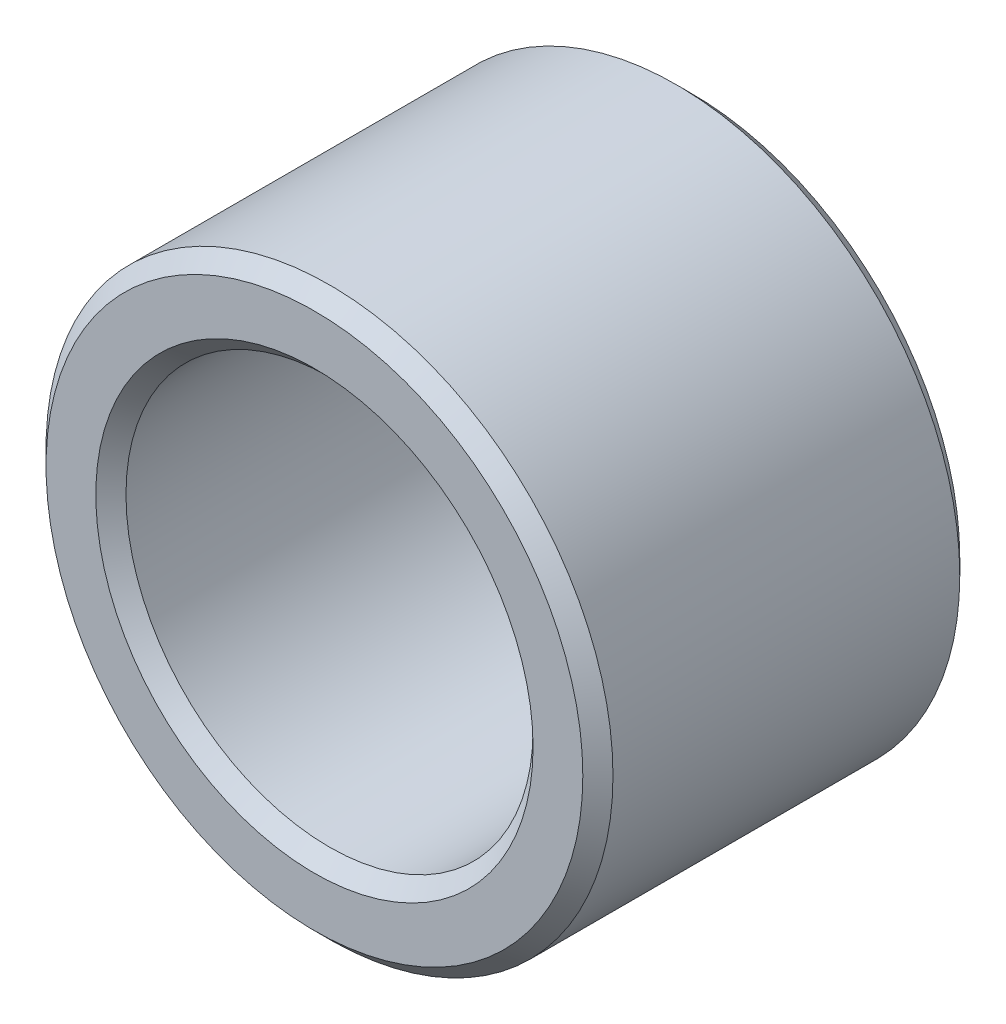
ISO-10303-21;
HEADER;
FILE_DESCRIPTION(('STEP AP214'),'2;1');
FILE_NAME('part.step','',(''),(''),'','','');
FILE_SCHEMA(('AUTOMOTIVE_DESIGN { 1 0 10303 214 1 1 1 1 }'));
ENDSEC;
DATA;
#1=APPLICATION_CONTEXT('core data for automotive mechanical design processes');
#2=APPLICATION_PROTOCOL_DEFINITION('international standard','automotive_design',2000,#1);
#3=PRODUCT_CONTEXT('',#1,'mechanical');
#4=PRODUCT('Part','Part','',(#3));
#5=PRODUCT_RELATED_PRODUCT_CATEGORY('part','',(#4));
#6=PRODUCT_DEFINITION_FORMATION('','',#4);
#7=PRODUCT_DEFINITION_CONTEXT('part definition',#1,'design');
#8=PRODUCT_DEFINITION('design','',#6,#7);
#9=PRODUCT_DEFINITION_SHAPE('','',#8);
#10=(LENGTH_UNIT() NAMED_UNIT(*) SI_UNIT(.MILLI.,.METRE.));
#11=(NAMED_UNIT(*) PLANE_ANGLE_UNIT() SI_UNIT($,.RADIAN.));
#12=(NAMED_UNIT(*) SI_UNIT($,.STERADIAN.) SOLID_ANGLE_UNIT());
#13=UNCERTAINTY_MEASURE_WITH_UNIT(LENGTH_MEASURE(1.E-05),#10,'distance_accuracy_value','');
#14=(GEOMETRIC_REPRESENTATION_CONTEXT(3) GLOBAL_UNCERTAINTY_ASSIGNED_CONTEXT((#13)) GLOBAL_UNIT_ASSIGNED_CONTEXT((#10,
#11,#12)) REPRESENTATION_CONTEXT('',''));
#15=CARTESIAN_POINT('',(0.,0.,0.));
#16=DIRECTION('',(0.,0.,1.));
#17=DIRECTION('',(1.,0.,0.));
#18=AXIS2_PLACEMENT_3D('',#15,#16,#17);
#19=CARTESIAN_POINT('',(0.,0.,3.175));
#20=DIRECTION('',(0.,0.,1.));
#21=DIRECTION('',(1.,0.,0.));
#22=AXIS2_PLACEMENT_3D('',#19,#20,#21);
#23=PLANE('',#22);
#24=CARTESIAN_POINT('',(0.,0.,3.175));
#25=DIRECTION('',(0.,0.,1.));
#26=DIRECTION('',(1.,0.,0.));
#27=AXIS2_PLACEMENT_3D('',#24,#25,#26);
#28=CIRCLE('',#27,3.683);
#29=CARTESIAN_POINT('',(3.683,0.,3.175));
#30=VERTEX_POINT('',#29);
#31=EDGE_CURVE('E10',#30,#30,#28,.F.);
#32=ORIENTED_EDGE('',*,*,#31,.T.);
#33=EDGE_LOOP('',(#32));
#34=FACE_BOUND('',#33,.T.);
#35=CARTESIAN_POINT('',(0.,0.,3.175));
#36=DIRECTION('',(0.,0.,1.));
#37=DIRECTION('',(1.,0.,0.));
#38=AXIS2_PLACEMENT_3D('',#35,#36,#37);
#39=CIRCLE('',#38,4.5212);
#40=CARTESIAN_POINT('',(4.5212,0.,3.175));
#41=VERTEX_POINT('',#40);
#42=EDGE_CURVE('E40',#41,#41,#39,.T.);
#43=ORIENTED_EDGE('',*,*,#42,.T.);
#44=EDGE_LOOP('',(#43));
#45=FACE_BOUND('',#44,.T.);
#46=ADVANCED_FACE('F32',(#34,#45),#23,.T.);
#47=CARTESIAN_POINT('',(0.,0.,-3.175));
#48=DIRECTION('',(0.,0.,1.));
#49=DIRECTION('',(1.,0.,0.));
#50=AXIS2_PLACEMENT_3D('',#47,#48,#49);
#51=PLANE('',#50);
#52=CARTESIAN_POINT('',(0.,0.,-3.175));
#53=DIRECTION('',(0.,0.,1.));
#54=DIRECTION('',(1.,0.,0.));
#55=AXIS2_PLACEMENT_3D('',#52,#53,#54);
#56=CIRCLE('',#55,3.683);
#57=CARTESIAN_POINT('',(3.683,0.,-3.175));
#58=VERTEX_POINT('',#57);
#59=EDGE_CURVE('E59',#58,#58,#56,.T.);
#60=ORIENTED_EDGE('',*,*,#59,.T.);
#61=EDGE_LOOP('',(#60));
#62=FACE_BOUND('',#61,.T.);
#63=CARTESIAN_POINT('',(0.,0.,-3.175));
#64=DIRECTION('',(0.,0.,1.));
#65=DIRECTION('',(1.,0.,0.));
#66=AXIS2_PLACEMENT_3D('',#63,#64,#65);
#67=CIRCLE('',#66,4.5212);
#68=CARTESIAN_POINT('',(4.5212,0.,-3.175));
#69=VERTEX_POINT('',#68);
#70=EDGE_CURVE('E62',#69,#69,#67,.F.);
#71=ORIENTED_EDGE('',*,*,#70,.T.);
#72=EDGE_LOOP('',(#71));
#73=FACE_BOUND('',#72,.T.);
#74=ADVANCED_FACE('F66',(#62,#73),#51,.F.);
#75=CARTESIAN_POINT('',(0.,0.,3.175));
#76=DIRECTION('',(0.,0.,-1.));
#77=DIRECTION('',(-1.,0.,0.));
#78=AXIS2_PLACEMENT_3D('',#75,#76,#77);
#79=CYLINDRICAL_SURFACE('',#78,4.7752);
#80=CARTESIAN_POINT('',(0.,0.,-2.921));
#81=DIRECTION('',(0.,0.,1.));
#82=DIRECTION('',(1.,0.,0.));
#83=AXIS2_PLACEMENT_3D('',#80,#81,#82);
#84=CIRCLE('',#83,4.7752);
#85=CARTESIAN_POINT('',(4.7752,0.,-2.921));
#86=VERTEX_POINT('',#85);
#87=EDGE_CURVE('E44',#86,#86,#84,.T.);
#88=ORIENTED_EDGE('',*,*,#87,.T.);
#89=EDGE_LOOP('',(#88));
#90=FACE_BOUND('',#89,.T.);
#91=CARTESIAN_POINT('',(0.,0.,2.921));
#92=DIRECTION('',(0.,0.,1.));
#93=DIRECTION('',(1.,0.,0.));
#94=AXIS2_PLACEMENT_3D('',#91,#92,#93);
#95=CIRCLE('',#94,4.7752);
#96=CARTESIAN_POINT('',(4.7752,0.,2.921));
#97=VERTEX_POINT('',#96);
#98=EDGE_CURVE('E48',#97,#97,#95,.F.);
#99=ORIENTED_EDGE('',*,*,#98,.T.);
#100=EDGE_LOOP('',(#99));
#101=FACE_BOUND('',#100,.T.);
#102=ADVANCED_FACE('F76',(#90,#101),#79,.T.);
#103=CARTESIAN_POINT('',(0.,0.,3.175));
#104=DIRECTION('',(0.,0.,-1.));
#105=DIRECTION('',(-1.,0.,0.));
#106=AXIS2_PLACEMENT_3D('',#103,#104,#105);
#107=CYLINDRICAL_SURFACE('',#106,3.429);
#108=CARTESIAN_POINT('',(0.,0.,-2.921));
#109=DIRECTION('',(0.,0.,1.));
#110=DIRECTION('',(1.,0.,0.));
#111=AXIS2_PLACEMENT_3D('',#108,#109,#110);
#112=CIRCLE('',#111,3.429);
#113=CARTESIAN_POINT('',(3.429,0.,-2.921));
#114=VERTEX_POINT('',#113);
#115=EDGE_CURVE('E53',#114,#114,#112,.F.);
#116=ORIENTED_EDGE('',*,*,#115,.T.);
#117=EDGE_LOOP('',(#116));
#118=FACE_BOUND('',#117,.T.);
#119=CARTESIAN_POINT('',(0.,0.,2.921));
#120=DIRECTION('',(0.,0.,1.));
#121=DIRECTION('',(1.,0.,0.));
#122=AXIS2_PLACEMENT_3D('',#119,#120,#121);
#123=CIRCLE('',#122,3.429);
#124=CARTESIAN_POINT('',(3.429,0.,2.921));
#125=VERTEX_POINT('',#124);
#126=EDGE_CURVE('E56',#125,#125,#123,.T.);
#127=ORIENTED_EDGE('',*,*,#126,.T.);
#128=EDGE_LOOP('',(#127));
#129=FACE_BOUND('',#128,.T.);
#130=ADVANCED_FACE('F79',(#118,#129),#107,.F.);
#131=CARTESIAN_POINT('',(0.,0.,-3.175));
#132=DIRECTION('',(0.,0.,-1.));
#133=DIRECTION('',(-1.,0.,0.));
#134=AXIS2_PLACEMENT_3D('',#131,#132,#133);
#135=CONICAL_SURFACE('',#134,3.683,0.78539816339745);
#136=ORIENTED_EDGE('',*,*,#115,.F.);
#137=EDGE_LOOP('',(#136));
#138=FACE_BOUND('',#137,.T.);
#139=ORIENTED_EDGE('',*,*,#59,.F.);
#140=EDGE_LOOP('',(#139));
#141=FACE_BOUND('',#140,.T.);
#142=ADVANCED_FACE('F72',(#138,#141),#135,.F.);
#143=CARTESIAN_POINT('',(0.,0.,-2.921));
#144=DIRECTION('',(0.,0.,1.));
#145=DIRECTION('',(1.,0.,0.));
#146=AXIS2_PLACEMENT_3D('',#143,#144,#145);
#147=CONICAL_SURFACE('',#146,4.7752,0.78539816339745);
#148=ORIENTED_EDGE('',*,*,#70,.F.);
#149=EDGE_LOOP('',(#148));
#150=FACE_BOUND('',#149,.T.);
#151=ORIENTED_EDGE('',*,*,#87,.F.);
#152=EDGE_LOOP('',(#151));
#153=FACE_BOUND('',#152,.T.);
#154=ADVANCED_FACE('F68',(#150,#153),#147,.T.);
#155=CARTESIAN_POINT('',(0.,0.,2.921));
#156=DIRECTION('',(0.,0.,1.));
#157=DIRECTION('',(1.,0.,0.));
#158=AXIS2_PLACEMENT_3D('',#155,#156,#157);
#159=CONICAL_SURFACE('',#158,3.429,0.785398163397452);
#160=ORIENTED_EDGE('',*,*,#31,.F.);
#161=EDGE_LOOP('',(#160));
#162=FACE_BOUND('',#161,.T.);
#163=ORIENTED_EDGE('',*,*,#126,.F.);
#164=EDGE_LOOP('',(#163));
#165=FACE_BOUND('',#164,.T.);
#166=ADVANCED_FACE('F71',(#162,#165),#159,.F.);
#167=CARTESIAN_POINT('',(0.,0.,3.175));
#168=DIRECTION('',(0.,0.,-1.));
#169=DIRECTION('',(-1.,0.,0.));
#170=AXIS2_PLACEMENT_3D('',#167,#168,#169);
#171=CONICAL_SURFACE('',#170,4.5212,0.78539816339745);
#172=ORIENTED_EDGE('',*,*,#98,.F.);
#173=EDGE_LOOP('',(#172));
#174=FACE_BOUND('',#173,.T.);
#175=ORIENTED_EDGE('',*,*,#42,.F.);
#176=EDGE_LOOP('',(#175));
#177=FACE_BOUND('',#176,.T.);
#178=ADVANCED_FACE('F35',(#174,#177),#171,.T.);
#179=CLOSED_SHELL('',(#46,#74,#102,#130,#142,#154,#166,#178));
#180=MANIFOLD_SOLID_BREP('B2',#179);
#181=ADVANCED_BREP_SHAPE_REPRESENTATION('',(#18,#180),#14);
#182=SHAPE_DEFINITION_REPRESENTATION(#9,#181);
ENDSEC;
END-ISO-10303-21;
